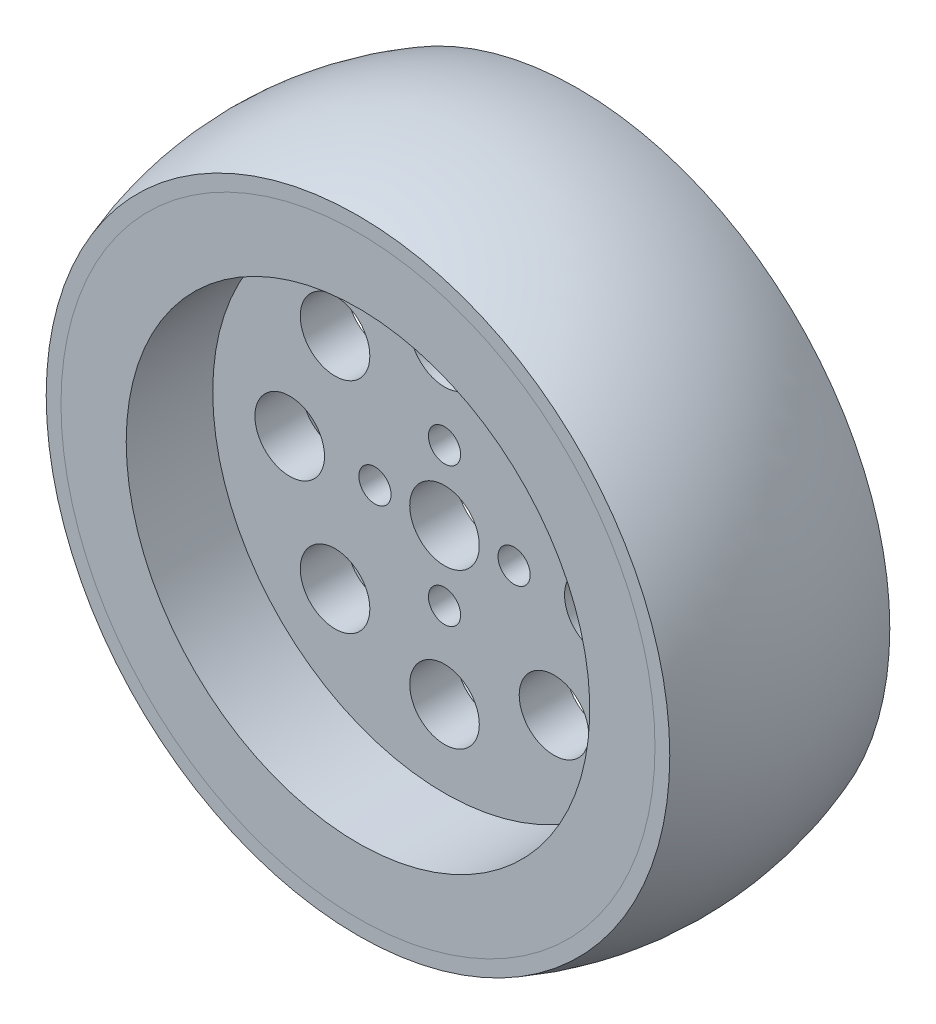
ISO-10303-21;
HEADER;
FILE_DESCRIPTION(('STEP AP214'),'2;1');
FILE_NAME('part.step','',(''),(''),'','','');
FILE_SCHEMA(('AUTOMOTIVE_DESIGN { 1 0 10303 214 1 1 1 1 }'));
ENDSEC;
DATA;
#1=APPLICATION_CONTEXT('core data for automotive mechanical design processes');
#2=APPLICATION_PROTOCOL_DEFINITION('international standard','automotive_design',2000,#1);
#3=PRODUCT_CONTEXT('',#1,'mechanical');
#4=PRODUCT('Part','Part','',(#3));
#5=PRODUCT_RELATED_PRODUCT_CATEGORY('part','',(#4));
#6=PRODUCT_DEFINITION_FORMATION('','',#4);
#7=PRODUCT_DEFINITION_CONTEXT('part definition',#1,'design');
#8=PRODUCT_DEFINITION('design','',#6,#7);
#9=PRODUCT_DEFINITION_SHAPE('','',#8);
#10=(LENGTH_UNIT() NAMED_UNIT(*) SI_UNIT(.MILLI.,.METRE.));
#11=(NAMED_UNIT(*) PLANE_ANGLE_UNIT() SI_UNIT($,.RADIAN.));
#12=(NAMED_UNIT(*) SI_UNIT($,.STERADIAN.) SOLID_ANGLE_UNIT());
#13=UNCERTAINTY_MEASURE_WITH_UNIT(LENGTH_MEASURE(1.E-05),#10,'distance_accuracy_value','');
#14=(GEOMETRIC_REPRESENTATION_CONTEXT(3) GLOBAL_UNCERTAINTY_ASSIGNED_CONTEXT((#13)) GLOBAL_UNIT_ASSIGNED_CONTEXT((#10,
#11,#12)) REPRESENTATION_CONTEXT('',''));
#15=CARTESIAN_POINT('',(0.,0.,0.));
#16=DIRECTION('',(0.,0.,1.));
#17=DIRECTION('',(1.,0.,0.));
#18=AXIS2_PLACEMENT_3D('',#15,#16,#17);
#19=CARTESIAN_POINT('',(26.65,0.,12.65));
#20=DIRECTION('',(0.,0.,-1.));
#21=DIRECTION('',(-1.,0.,0.));
#22=AXIS2_PLACEMENT_3D('',#19,#20,#21);
#23=PLANE('',#22);
#24=CARTESIAN_POINT('',(0.,0.,12.65));
#25=DIRECTION('',(0.,0.,-1.));
#26=DIRECTION('',(-1.,0.,0.));
#27=AXIS2_PLACEMENT_3D('',#24,#25,#26);
#28=CIRCLE('',#27,26.65);
#29=CARTESIAN_POINT('',(-26.65,0.,12.65));
#30=VERTEX_POINT('',#29);
#31=EDGE_CURVE('P0_E161',#30,#30,#28,.T.);
#32=ORIENTED_EDGE('',*,*,#31,.T.);
#33=EDGE_LOOP('',(#32));
#34=FACE_BOUND('',#33,.T.);
#35=CARTESIAN_POINT('',(0.,0.,12.65));
#36=DIRECTION('',(0.,0.,-1.));
#37=DIRECTION('',(-1.,0.,0.));
#38=AXIS2_PLACEMENT_3D('',#35,#36,#37);
#39=CIRCLE('',#38,34.15);
#40=CARTESIAN_POINT('',(-34.15,0.,12.65));
#41=VERTEX_POINT('',#40);
#42=EDGE_CURVE('P0_E10',#41,#41,#39,.T.);
#43=ORIENTED_EDGE('',*,*,#42,.F.);
#44=EDGE_LOOP('',(#43));
#45=FACE_BOUND('',#44,.T.);
#46=ADVANCED_FACE('P0_F15',(#34,#45),#23,.F.);
#47=CARTESIAN_POINT('',(0.,0.,-12.65));
#48=DIRECTION('',(0.,0.,-1.));
#49=DIRECTION('',(-1.,0.,0.));
#50=AXIS2_PLACEMENT_3D('',#47,#48,#49);
#51=CYLINDRICAL_SURFACE('',#50,34.15);
#52=CARTESIAN_POINT('',(0.,0.,10.65));
#53=DIRECTION('',(0.,0.,-1.));
#54=DIRECTION('',(-1.,0.,0.));
#55=AXIS2_PLACEMENT_3D('',#52,#53,#54);
#56=CIRCLE('',#55,34.15);
#57=CARTESIAN_POINT('',(-34.15,0.,10.65));
#58=VERTEX_POINT('',#57);
#59=EDGE_CURVE('P0_E22',#58,#58,#56,.T.);
#60=ORIENTED_EDGE('',*,*,#59,.F.);
#61=EDGE_LOOP('',(#60));
#62=FACE_BOUND('',#61,.T.);
#63=ORIENTED_EDGE('',*,*,#42,.T.);
#64=EDGE_LOOP('',(#63));
#65=FACE_BOUND('',#64,.T.);
#66=ADVANCED_FACE('P0_F203',(#62,#65),#51,.T.);
#67=CARTESIAN_POINT('',(34.15,0.,10.65));
#68=DIRECTION('',(0.,0.,1.));
#69=DIRECTION('',(1.,0.,0.));
#70=AXIS2_PLACEMENT_3D('',#67,#68,#69);
#71=PLANE('',#70);
#72=CARTESIAN_POINT('',(0.,0.,10.65));
#73=DIRECTION('',(0.,0.,-1.));
#74=DIRECTION('',(-1.,0.,0.));
#75=AXIS2_PLACEMENT_3D('',#72,#73,#74);
#76=CIRCLE('',#75,31.85);
#77=CARTESIAN_POINT('',(-31.85,0.,10.65));
#78=VERTEX_POINT('',#77);
#79=EDGE_CURVE('P0_E29',#78,#78,#76,.T.);
#80=ORIENTED_EDGE('',*,*,#79,.F.);
#81=EDGE_LOOP('',(#80));
#82=FACE_BOUND('',#81,.T.);
#83=ORIENTED_EDGE('',*,*,#59,.T.);
#84=EDGE_LOOP('',(#83));
#85=FACE_BOUND('',#84,.T.);
#86=ADVANCED_FACE('P0_F198',(#82,#85),#71,.F.);
#87=CARTESIAN_POINT('',(0.,0.,-12.65));
#88=DIRECTION('',(0.,0.,-1.));
#89=DIRECTION('',(-1.,0.,0.));
#90=AXIS2_PLACEMENT_3D('',#87,#88,#89);
#91=CYLINDRICAL_SURFACE('',#90,31.85);
#92=CARTESIAN_POINT('',(0.,0.,-10.65));
#93=DIRECTION('',(0.,0.,-1.));
#94=DIRECTION('',(-1.,0.,0.));
#95=AXIS2_PLACEMENT_3D('',#92,#93,#94);
#96=CIRCLE('',#95,31.85);
#97=CARTESIAN_POINT('',(-31.85,0.,-10.65));
#98=VERTEX_POINT('',#97);
#99=EDGE_CURVE('P0_E35',#98,#98,#96,.T.);
#100=ORIENTED_EDGE('',*,*,#99,.F.);
#101=EDGE_LOOP('',(#100));
#102=FACE_BOUND('',#101,.T.);
#103=ORIENTED_EDGE('',*,*,#79,.T.);
#104=EDGE_LOOP('',(#103));
#105=FACE_BOUND('',#104,.T.);
#106=ADVANCED_FACE('P0_F192',(#102,#105),#91,.T.);
#107=CARTESIAN_POINT('',(31.85,0.,-10.65));
#108=DIRECTION('',(0.,0.,-1.));
#109=DIRECTION('',(-1.,0.,0.));
#110=AXIS2_PLACEMENT_3D('',#107,#108,#109);
#111=PLANE('',#110);
#112=CARTESIAN_POINT('',(0.,0.,-10.65));
#113=DIRECTION('',(0.,0.,-1.));
#114=DIRECTION('',(-1.,0.,0.));
#115=AXIS2_PLACEMENT_3D('',#112,#113,#114);
#116=CIRCLE('',#115,34.15);
#117=CARTESIAN_POINT('',(-34.15,0.,-10.65));
#118=VERTEX_POINT('',#117);
#119=EDGE_CURVE('P0_E41',#118,#118,#116,.T.);
#120=ORIENTED_EDGE('',*,*,#119,.F.);
#121=EDGE_LOOP('',(#120));
#122=FACE_BOUND('',#121,.T.);
#123=ORIENTED_EDGE('',*,*,#99,.T.);
#124=EDGE_LOOP('',(#123));
#125=FACE_BOUND('',#124,.T.);
#126=ADVANCED_FACE('P0_F186',(#122,#125),#111,.F.);
#127=CARTESIAN_POINT('',(0.,0.,-12.65));
#128=DIRECTION('',(0.,0.,-1.));
#129=DIRECTION('',(-1.,0.,0.));
#130=AXIS2_PLACEMENT_3D('',#127,#128,#129);
#131=CYLINDRICAL_SURFACE('',#130,34.15);
#132=CARTESIAN_POINT('',(0.,0.,-12.65));
#133=DIRECTION('',(0.,0.,-1.));
#134=DIRECTION('',(-1.,0.,0.));
#135=AXIS2_PLACEMENT_3D('',#132,#133,#134);
#136=CIRCLE('',#135,34.15);
#137=CARTESIAN_POINT('',(-34.15,0.,-12.65));
#138=VERTEX_POINT('',#137);
#139=EDGE_CURVE('P0_E45',#138,#138,#136,.T.);
#140=ORIENTED_EDGE('',*,*,#139,.F.);
#141=EDGE_LOOP('',(#140));
#142=FACE_BOUND('',#141,.T.);
#143=ORIENTED_EDGE('',*,*,#119,.T.);
#144=EDGE_LOOP('',(#143));
#145=FACE_BOUND('',#144,.T.);
#146=ADVANCED_FACE('P0_F180',(#142,#145),#131,.T.);
#147=CARTESIAN_POINT('',(34.15,0.,-12.65));
#148=DIRECTION('',(0.,0.,1.));
#149=DIRECTION('',(1.,0.,0.));
#150=AXIS2_PLACEMENT_3D('',#147,#148,#149);
#151=PLANE('',#150);
#152=CARTESIAN_POINT('',(0.,0.,-12.65));
#153=DIRECTION('',(0.,0.,-1.));
#154=DIRECTION('',(-1.,0.,0.));
#155=AXIS2_PLACEMENT_3D('',#152,#153,#154);
#156=CIRCLE('',#155,26.65);
#157=CARTESIAN_POINT('',(-26.65,0.,-12.65));
#158=VERTEX_POINT('',#157);
#159=EDGE_CURVE('P0_E165',#158,#158,#156,.T.);
#160=ORIENTED_EDGE('',*,*,#159,.F.);
#161=EDGE_LOOP('',(#160));
#162=FACE_BOUND('',#161,.T.);
#163=ORIENTED_EDGE('',*,*,#139,.T.);
#164=EDGE_LOOP('',(#163));
#165=FACE_BOUND('',#164,.T.);
#166=ADVANCED_FACE('P0_F176',(#162,#165),#151,.F.);
#167=CARTESIAN_POINT('',(0.,0.,-12.65));
#168=DIRECTION('',(0.,0.,-1.));
#169=DIRECTION('',(-1.,0.,0.));
#170=AXIS2_PLACEMENT_3D('',#167,#168,#169);
#171=CYLINDRICAL_SURFACE('',#170,26.65);
#172=ORIENTED_EDGE('',*,*,#31,.F.);
#173=EDGE_LOOP('',(#172));
#174=FACE_BOUND('',#173,.T.);
#175=CARTESIAN_POINT('',(0.,0.,2.70000000000001));
#176=DIRECTION('',(0.,0.,-1.));
#177=DIRECTION('',(-1.,0.,0.));
#178=AXIS2_PLACEMENT_3D('',#175,#176,#177);
#179=CIRCLE('',#178,26.65);
#180=CARTESIAN_POINT('',(-26.65,0.,2.70000000000002));
#181=VERTEX_POINT('',#180);
#182=EDGE_CURVE('P0_E101',#181,#181,#179,.T.);
#183=ORIENTED_EDGE('',*,*,#182,.T.);
#184=EDGE_LOOP('',(#183));
#185=FACE_BOUND('',#184,.T.);
#186=ADVANCED_FACE('P0_F179',(#174,#185),#171,.F.);
#187=CARTESIAN_POINT('',(0.,0.,-12.65));
#188=DIRECTION('',(0.,0.,-1.));
#189=DIRECTION('',(-1.,0.,0.));
#190=AXIS2_PLACEMENT_3D('',#187,#188,#189);
#191=CYLINDRICAL_SURFACE('',#190,26.65);
#192=CARTESIAN_POINT('',(0.,0.,-2.69999999999999));
#193=DIRECTION('',(0.,0.,-1.));
#194=DIRECTION('',(-1.,0.,0.));
#195=AXIS2_PLACEMENT_3D('',#192,#193,#194);
#196=CIRCLE('',#195,26.65);
#197=CARTESIAN_POINT('',(-26.65,0.,-2.69999999999998));
#198=VERTEX_POINT('',#197);
#199=EDGE_CURVE('P0_E49',#198,#198,#196,.T.);
#200=ORIENTED_EDGE('',*,*,#199,.F.);
#201=EDGE_LOOP('',(#200));
#202=FACE_BOUND('',#201,.T.);
#203=ORIENTED_EDGE('',*,*,#159,.T.);
#204=EDGE_LOOP('',(#203));
#205=FACE_BOUND('',#204,.T.);
#206=ADVANCED_FACE('P0_F174',(#202,#205),#191,.F.);
#207=CARTESIAN_POINT('',(0.,8.,-12.65));
#208=DIRECTION('',(0.,0.,1.));
#209=DIRECTION('',(1.,0.,0.));
#210=AXIS2_PLACEMENT_3D('',#207,#208,#209);
#211=CYLINDRICAL_SURFACE('',#210,1.85);
#212=CARTESIAN_POINT('',(0.,8.,2.7));
#213=DIRECTION('',(0.,0.,-1.));
#214=DIRECTION('',(-1.,0.,0.));
#215=AXIS2_PLACEMENT_3D('',#212,#213,#214);
#216=CIRCLE('',#215,1.85);
#217=CARTESIAN_POINT('',(-1.85,8.,2.70000000000001));
#218=VERTEX_POINT('',#217);
#219=EDGE_CURVE('P0_E105',#218,#218,#216,.T.);
#220=ORIENTED_EDGE('',*,*,#219,.F.);
#221=EDGE_LOOP('',(#220));
#222=FACE_BOUND('',#221,.T.);
#223=CARTESIAN_POINT('',(0.,8.,-2.69999999999999));
#224=DIRECTION('',(0.,0.,1.));
#225=DIRECTION('',(1.,0.,0.));
#226=AXIS2_PLACEMENT_3D('',#223,#224,#225);
#227=CIRCLE('',#226,1.85);
#228=CARTESIAN_POINT('',(1.85,8.,-2.69999999999999));
#229=VERTEX_POINT('',#228);
#230=EDGE_CURVE('P0_E53',#229,#229,#227,.T.);
#231=ORIENTED_EDGE('',*,*,#230,.F.);
#232=EDGE_LOOP('',(#231));
#233=FACE_BOUND('',#232,.T.);
#234=ADVANCED_FACE('P0_F245',(#222,#233),#211,.F.);
#235=CARTESIAN_POINT('',(8.,0.,-12.65));
#236=DIRECTION('',(0.,0.,1.));
#237=DIRECTION('',(1.,0.,0.));
#238=AXIS2_PLACEMENT_3D('',#235,#236,#237);
#239=CYLINDRICAL_SURFACE('',#238,1.85);
#240=CARTESIAN_POINT('',(8.,0.,2.7));
#241=DIRECTION('',(0.,0.,-1.));
#242=DIRECTION('',(-1.,0.,0.));
#243=AXIS2_PLACEMENT_3D('',#240,#241,#242);
#244=CIRCLE('',#243,1.85);
#245=CARTESIAN_POINT('',(6.15,0.,2.7));
#246=VERTEX_POINT('',#245);
#247=EDGE_CURVE('P0_E109',#246,#246,#244,.T.);
#248=ORIENTED_EDGE('',*,*,#247,.F.);
#249=EDGE_LOOP('',(#248));
#250=FACE_BOUND('',#249,.T.);
#251=CARTESIAN_POINT('',(8.,0.,-2.7));
#252=DIRECTION('',(0.,0.,1.));
#253=DIRECTION('',(1.,0.,0.));
#254=AXIS2_PLACEMENT_3D('',#251,#252,#253);
#255=CIRCLE('',#254,1.85);
#256=CARTESIAN_POINT('',(9.85,0.,-2.7));
#257=VERTEX_POINT('',#256);
#258=EDGE_CURVE('P0_E57',#257,#257,#255,.T.);
#259=ORIENTED_EDGE('',*,*,#258,.F.);
#260=EDGE_LOOP('',(#259));
#261=FACE_BOUND('',#260,.T.);
#262=ADVANCED_FACE('P0_F250',(#250,#261),#239,.F.);
#263=CARTESIAN_POINT('',(0.,-8.,-12.65));
#264=DIRECTION('',(0.,0.,1.));
#265=DIRECTION('',(1.,0.,0.));
#266=AXIS2_PLACEMENT_3D('',#263,#264,#265);
#267=CYLINDRICAL_SURFACE('',#266,1.85);
#268=CARTESIAN_POINT('',(0.,-8.,2.7));
#269=DIRECTION('',(0.,0.,-1.));
#270=DIRECTION('',(-1.,0.,0.));
#271=AXIS2_PLACEMENT_3D('',#268,#269,#270);
#272=CIRCLE('',#271,1.85);
#273=CARTESIAN_POINT('',(-1.85,-8.,2.70000000000001));
#274=VERTEX_POINT('',#273);
#275=EDGE_CURVE('P0_E113',#274,#274,#272,.T.);
#276=ORIENTED_EDGE('',*,*,#275,.F.);
#277=EDGE_LOOP('',(#276));
#278=FACE_BOUND('',#277,.T.);
#279=CARTESIAN_POINT('',(0.,-8.,-2.69999999999999));
#280=DIRECTION('',(0.,0.,1.));
#281=DIRECTION('',(1.,0.,0.));
#282=AXIS2_PLACEMENT_3D('',#279,#280,#281);
#283=CIRCLE('',#282,1.85);
#284=CARTESIAN_POINT('',(1.85,-8.,-2.69999999999999));
#285=VERTEX_POINT('',#284);
#286=EDGE_CURVE('P0_E61',#285,#285,#283,.T.);
#287=ORIENTED_EDGE('',*,*,#286,.F.);
#288=EDGE_LOOP('',(#287));
#289=FACE_BOUND('',#288,.T.);
#290=ADVANCED_FACE('P0_F256',(#278,#289),#267,.F.);
#291=CARTESIAN_POINT('',(-8.,0.,-12.65));
#292=DIRECTION('',(0.,0.,1.));
#293=DIRECTION('',(1.,0.,0.));
#294=AXIS2_PLACEMENT_3D('',#291,#292,#293);
#295=CYLINDRICAL_SURFACE('',#294,1.85);
#296=CARTESIAN_POINT('',(-8.,0.,2.70000000000001));
#297=DIRECTION('',(0.,0.,-1.));
#298=DIRECTION('',(-1.,0.,0.));
#299=AXIS2_PLACEMENT_3D('',#296,#297,#298);
#300=CIRCLE('',#299,1.85);
#301=CARTESIAN_POINT('',(-9.85,0.,2.70000000000001));
#302=VERTEX_POINT('',#301);
#303=EDGE_CURVE('P0_E117',#302,#302,#300,.T.);
#304=ORIENTED_EDGE('',*,*,#303,.F.);
#305=EDGE_LOOP('',(#304));
#306=FACE_BOUND('',#305,.T.);
#307=CARTESIAN_POINT('',(-8.,0.,-2.69999999999999));
#308=DIRECTION('',(0.,0.,1.));
#309=DIRECTION('',(1.,0.,0.));
#310=AXIS2_PLACEMENT_3D('',#307,#308,#309);
#311=CIRCLE('',#310,1.85);
#312=CARTESIAN_POINT('',(-6.15,0.,-2.69999999999999));
#313=VERTEX_POINT('',#312);
#314=EDGE_CURVE('P0_E65',#313,#313,#311,.T.);
#315=ORIENTED_EDGE('',*,*,#314,.F.);
#316=EDGE_LOOP('',(#315));
#317=FACE_BOUND('',#316,.T.);
#318=ADVANCED_FACE('P0_F260',(#306,#317),#295,.F.);
#319=CARTESIAN_POINT('',(0.,17.8,-12.65));
#320=DIRECTION('',(0.,0.,1.));
#321=DIRECTION('',(1.,0.,0.));
#322=AXIS2_PLACEMENT_3D('',#319,#320,#321);
#323=CYLINDRICAL_SURFACE('',#322,4.);
#324=CARTESIAN_POINT('',(0.,17.8,2.7));
#325=DIRECTION('',(0.,0.,-1.));
#326=DIRECTION('',(-1.,0.,0.));
#327=AXIS2_PLACEMENT_3D('',#324,#325,#326);
#328=CIRCLE('',#327,4.);
#329=CARTESIAN_POINT('',(-4.,17.8,2.70000000000001));
#330=VERTEX_POINT('',#329);
#331=EDGE_CURVE('P0_E121',#330,#330,#328,.T.);
#332=ORIENTED_EDGE('',*,*,#331,.F.);
#333=EDGE_LOOP('',(#332));
#334=FACE_BOUND('',#333,.T.);
#335=CARTESIAN_POINT('',(0.,17.8,-2.69999999999999));
#336=DIRECTION('',(0.,0.,1.));
#337=DIRECTION('',(1.,0.,0.));
#338=AXIS2_PLACEMENT_3D('',#335,#336,#337);
#339=CIRCLE('',#338,4.);
#340=CARTESIAN_POINT('',(4.,17.8,-2.7));
#341=VERTEX_POINT('',#340);
#342=EDGE_CURVE('P0_E69',#341,#341,#339,.T.);
#343=ORIENTED_EDGE('',*,*,#342,.F.);
#344=EDGE_LOOP('',(#343));
#345=FACE_BOUND('',#344,.T.);
#346=ADVANCED_FACE('P0_F264',(#334,#345),#323,.F.);
#347=CARTESIAN_POINT('',(12.5865007051205,12.5865007051206,-12.65));
#348=DIRECTION('',(0.,0.,1.));
#349=DIRECTION('',(1.,0.,0.));
#350=AXIS2_PLACEMENT_3D('',#347,#348,#349);
#351=CYLINDRICAL_SURFACE('',#350,3.99999999999999);
#352=CARTESIAN_POINT('',(12.5865007051205,12.5865007051206,2.7));
#353=DIRECTION('',(0.,0.,-1.));
#354=DIRECTION('',(-1.,0.,0.));
#355=AXIS2_PLACEMENT_3D('',#352,#353,#354);
#356=CIRCLE('',#355,3.99999999999999);
#357=CARTESIAN_POINT('',(8.58650070512047,12.5865007051206,2.7));
#358=VERTEX_POINT('',#357);
#359=EDGE_CURVE('P0_E125',#358,#358,#356,.T.);
#360=ORIENTED_EDGE('',*,*,#359,.F.);
#361=EDGE_LOOP('',(#360));
#362=FACE_BOUND('',#361,.T.);
#363=CARTESIAN_POINT('',(12.5865007051205,12.5865007051206,-2.7));
#364=DIRECTION('',(0.,0.,1.));
#365=DIRECTION('',(1.,0.,0.));
#366=AXIS2_PLACEMENT_3D('',#363,#364,#365);
#367=CIRCLE('',#366,3.99999999999999);
#368=CARTESIAN_POINT('',(16.5865007051205,12.5865007051206,-2.7));
#369=VERTEX_POINT('',#368);
#370=EDGE_CURVE('P0_E73',#369,#369,#367,.T.);
#371=ORIENTED_EDGE('',*,*,#370,.F.);
#372=EDGE_LOOP('',(#371));
#373=FACE_BOUND('',#372,.T.);
#374=ADVANCED_FACE('P0_F268',(#362,#373),#351,.F.);
#375=CARTESIAN_POINT('',(17.8,0.,-12.65));
#376=DIRECTION('',(0.,0.,1.));
#377=DIRECTION('',(1.,0.,0.));
#378=AXIS2_PLACEMENT_3D('',#375,#376,#377);
#379=CYLINDRICAL_SURFACE('',#378,4.);
#380=CARTESIAN_POINT('',(17.8,0.,2.7));
#381=DIRECTION('',(0.,0.,-1.));
#382=DIRECTION('',(-1.,0.,0.));
#383=AXIS2_PLACEMENT_3D('',#380,#381,#382);
#384=CIRCLE('',#383,4.);
#385=CARTESIAN_POINT('',(13.8,0.,2.7));
#386=VERTEX_POINT('',#385);
#387=EDGE_CURVE('P0_E129',#386,#386,#384,.T.);
#388=ORIENTED_EDGE('',*,*,#387,.F.);
#389=EDGE_LOOP('',(#388));
#390=FACE_BOUND('',#389,.T.);
#391=CARTESIAN_POINT('',(17.8,0.,-2.7));
#392=DIRECTION('',(0.,0.,1.));
#393=DIRECTION('',(1.,0.,0.));
#394=AXIS2_PLACEMENT_3D('',#391,#392,#393);
#395=CIRCLE('',#394,4.);
#396=CARTESIAN_POINT('',(21.8,0.,-2.7));
#397=VERTEX_POINT('',#396);
#398=EDGE_CURVE('P0_E77',#397,#397,#395,.T.);
#399=ORIENTED_EDGE('',*,*,#398,.F.);
#400=EDGE_LOOP('',(#399));
#401=FACE_BOUND('',#400,.T.);
#402=ADVANCED_FACE('P0_F272',(#390,#401),#379,.F.);
#403=CARTESIAN_POINT('',(12.5865007051206,-12.5865007051205,-12.65));
#404=DIRECTION('',(0.,0.,1.));
#405=DIRECTION('',(1.,0.,0.));
#406=AXIS2_PLACEMENT_3D('',#403,#404,#405);
#407=CYLINDRICAL_SURFACE('',#406,4.);
#408=CARTESIAN_POINT('',(12.5865007051206,-12.5865007051205,2.7));
#409=DIRECTION('',(0.,0.,-1.));
#410=DIRECTION('',(-1.,0.,0.));
#411=AXIS2_PLACEMENT_3D('',#408,#409,#410);
#412=CIRCLE('',#411,4.);
#413=CARTESIAN_POINT('',(8.58650070512061,-12.5865007051205,2.7));
#414=VERTEX_POINT('',#413);
#415=EDGE_CURVE('P0_E133',#414,#414,#412,.T.);
#416=ORIENTED_EDGE('',*,*,#415,.F.);
#417=EDGE_LOOP('',(#416));
#418=FACE_BOUND('',#417,.T.);
#419=CARTESIAN_POINT('',(12.5865007051206,-12.5865007051205,-2.7));
#420=DIRECTION('',(0.,0.,1.));
#421=DIRECTION('',(1.,0.,0.));
#422=AXIS2_PLACEMENT_3D('',#419,#420,#421);
#423=CIRCLE('',#422,4.);
#424=CARTESIAN_POINT('',(16.5865007051206,-12.5865007051205,-2.7));
#425=VERTEX_POINT('',#424);
#426=EDGE_CURVE('P0_E81',#425,#425,#423,.T.);
#427=ORIENTED_EDGE('',*,*,#426,.F.);
#428=EDGE_LOOP('',(#427));
#429=FACE_BOUND('',#428,.T.);
#430=ADVANCED_FACE('P0_F276',(#418,#429),#407,.F.);
#431=CARTESIAN_POINT('',(0.,-17.8,-12.65));
#432=DIRECTION('',(0.,0.,1.));
#433=DIRECTION('',(1.,0.,0.));
#434=AXIS2_PLACEMENT_3D('',#431,#432,#433);
#435=CYLINDRICAL_SURFACE('',#434,4.);
#436=CARTESIAN_POINT('',(0.,-17.8,2.7));
#437=DIRECTION('',(0.,0.,-1.));
#438=DIRECTION('',(-1.,0.,0.));
#439=AXIS2_PLACEMENT_3D('',#436,#437,#438);
#440=CIRCLE('',#439,4.);
#441=CARTESIAN_POINT('',(-4.,-17.8,2.70000000000001));
#442=VERTEX_POINT('',#441);
#443=EDGE_CURVE('P0_E137',#442,#442,#440,.T.);
#444=ORIENTED_EDGE('',*,*,#443,.F.);
#445=EDGE_LOOP('',(#444));
#446=FACE_BOUND('',#445,.T.);
#447=CARTESIAN_POINT('',(0.,-17.8,-2.69999999999999));
#448=DIRECTION('',(0.,0.,1.));
#449=DIRECTION('',(1.,0.,0.));
#450=AXIS2_PLACEMENT_3D('',#447,#448,#449);
#451=CIRCLE('',#450,4.);
#452=CARTESIAN_POINT('',(4.,-17.8,-2.7));
#453=VERTEX_POINT('',#452);
#454=EDGE_CURVE('P0_E85',#453,#453,#451,.T.);
#455=ORIENTED_EDGE('',*,*,#454,.F.);
#456=EDGE_LOOP('',(#455));
#457=FACE_BOUND('',#456,.T.);
#458=ADVANCED_FACE('P0_F280',(#446,#457),#435,.F.);
#459=CARTESIAN_POINT('',(-12.5865007051205,-12.5865007051206,-12.65));
#460=DIRECTION('',(0.,0.,1.));
#461=DIRECTION('',(1.,0.,0.));
#462=AXIS2_PLACEMENT_3D('',#459,#460,#461);
#463=CYLINDRICAL_SURFACE('',#462,4.);
#464=CARTESIAN_POINT('',(-12.5865007051205,-12.5865007051206,2.70000000000001));
#465=DIRECTION('',(0.,0.,-1.));
#466=DIRECTION('',(-1.,0.,0.));
#467=AXIS2_PLACEMENT_3D('',#464,#465,#466);
#468=CIRCLE('',#467,4.);
#469=CARTESIAN_POINT('',(-16.5865007051205,-12.5865007051206,2.70000000000001));
#470=VERTEX_POINT('',#469);
#471=EDGE_CURVE('P0_E141',#470,#470,#468,.T.);
#472=ORIENTED_EDGE('',*,*,#471,.F.);
#473=EDGE_LOOP('',(#472));
#474=FACE_BOUND('',#473,.T.);
#475=CARTESIAN_POINT('',(-12.5865007051205,-12.5865007051206,-2.69999999999999));
#476=DIRECTION('',(0.,0.,1.));
#477=DIRECTION('',(1.,0.,0.));
#478=AXIS2_PLACEMENT_3D('',#475,#476,#477);
#479=CIRCLE('',#478,4.);
#480=CARTESIAN_POINT('',(-8.58650070512048,-12.5865007051206,-2.69999999999999));
#481=VERTEX_POINT('',#480);
#482=EDGE_CURVE('P0_E89',#481,#481,#479,.T.);
#483=ORIENTED_EDGE('',*,*,#482,.F.);
#484=EDGE_LOOP('',(#483));
#485=FACE_BOUND('',#484,.T.);
#486=ADVANCED_FACE('P0_F284',(#474,#485),#463,.F.);
#487=CARTESIAN_POINT('',(-17.8,0.,-12.65));
#488=DIRECTION('',(0.,0.,1.));
#489=DIRECTION('',(1.,0.,0.));
#490=AXIS2_PLACEMENT_3D('',#487,#488,#489);
#491=CYLINDRICAL_SURFACE('',#490,4.);
#492=CARTESIAN_POINT('',(-17.8,0.,2.70000000000001));
#493=DIRECTION('',(0.,0.,-1.));
#494=DIRECTION('',(-1.,0.,0.));
#495=AXIS2_PLACEMENT_3D('',#492,#493,#494);
#496=CIRCLE('',#495,4.);
#497=CARTESIAN_POINT('',(-21.8,0.,2.70000000000001));
#498=VERTEX_POINT('',#497);
#499=EDGE_CURVE('P0_E145',#498,#498,#496,.T.);
#500=ORIENTED_EDGE('',*,*,#499,.F.);
#501=EDGE_LOOP('',(#500));
#502=FACE_BOUND('',#501,.T.);
#503=CARTESIAN_POINT('',(-17.8,0.,-2.69999999999999));
#504=DIRECTION('',(0.,0.,1.));
#505=DIRECTION('',(1.,0.,0.));
#506=AXIS2_PLACEMENT_3D('',#503,#504,#505);
#507=CIRCLE('',#506,4.);
#508=CARTESIAN_POINT('',(-13.8,0.,-2.69999999999999));
#509=VERTEX_POINT('',#508);
#510=EDGE_CURVE('P0_E93',#509,#509,#507,.T.);
#511=ORIENTED_EDGE('',*,*,#510,.F.);
#512=EDGE_LOOP('',(#511));
#513=FACE_BOUND('',#512,.T.);
#514=ADVANCED_FACE('P0_F239',(#502,#513),#491,.F.);
#515=CARTESIAN_POINT('',(26.65,0.,-2.7));
#516=DIRECTION('',(0.,0.,1.));
#517=DIRECTION('',(1.,0.,0.));
#518=AXIS2_PLACEMENT_3D('',#515,#516,#517);
#519=PLANE('',#518);
#520=CARTESIAN_POINT('',(-12.5865007051206,12.5865007051205,-2.69999999999999));
#521=DIRECTION('',(0.,0.,1.));
#522=DIRECTION('',(1.,0.,0.));
#523=AXIS2_PLACEMENT_3D('',#520,#521,#522);
#524=CIRCLE('',#523,4.);
#525=CARTESIAN_POINT('',(-8.58650070512062,12.5865007051205,-2.69999999999999));
#526=VERTEX_POINT('',#525);
#527=EDGE_CURVE('P0_E97',#526,#526,#524,.T.);
#528=ORIENTED_EDGE('',*,*,#527,.T.);
#529=EDGE_LOOP('',(#528));
#530=FACE_BOUND('',#529,.T.);
#531=ORIENTED_EDGE('',*,*,#510,.T.);
#532=EDGE_LOOP('',(#531));
#533=FACE_BOUND('',#532,.T.);
#534=ORIENTED_EDGE('',*,*,#482,.T.);
#535=EDGE_LOOP('',(#534));
#536=FACE_BOUND('',#535,.T.);
#537=ORIENTED_EDGE('',*,*,#454,.T.);
#538=EDGE_LOOP('',(#537));
#539=FACE_BOUND('',#538,.T.);
#540=ORIENTED_EDGE('',*,*,#426,.T.);
#541=EDGE_LOOP('',(#540));
#542=FACE_BOUND('',#541,.T.);
#543=ORIENTED_EDGE('',*,*,#398,.T.);
#544=EDGE_LOOP('',(#543));
#545=FACE_BOUND('',#544,.T.);
#546=ORIENTED_EDGE('',*,*,#370,.T.);
#547=EDGE_LOOP('',(#546));
#548=FACE_BOUND('',#547,.T.);
#549=ORIENTED_EDGE('',*,*,#342,.T.);
#550=EDGE_LOOP('',(#549));
#551=FACE_BOUND('',#550,.T.);
#552=ORIENTED_EDGE('',*,*,#314,.T.);
#553=EDGE_LOOP('',(#552));
#554=FACE_BOUND('',#553,.T.);
#555=ORIENTED_EDGE('',*,*,#286,.T.);
#556=EDGE_LOOP('',(#555));
#557=FACE_BOUND('',#556,.T.);
#558=ORIENTED_EDGE('',*,*,#258,.T.);
#559=EDGE_LOOP('',(#558));
#560=FACE_BOUND('',#559,.T.);
#561=ORIENTED_EDGE('',*,*,#230,.T.);
#562=EDGE_LOOP('',(#561));
#563=FACE_BOUND('',#562,.T.);
#564=CARTESIAN_POINT('',(0.,0.,-2.7));
#565=DIRECTION('',(0.,0.,-1.));
#566=DIRECTION('',(-1.,0.,0.));
#567=AXIS2_PLACEMENT_3D('',#564,#565,#566);
#568=CIRCLE('',#567,4.);
#569=CARTESIAN_POINT('',(-4.00000000000001,0.,-2.69999999999999));
#570=VERTEX_POINT('',#569);
#571=EDGE_CURVE('P0_E153',#570,#570,#568,.T.);
#572=ORIENTED_EDGE('',*,*,#571,.F.);
#573=EDGE_LOOP('',(#572));
#574=FACE_BOUND('',#573,.T.);
#575=ORIENTED_EDGE('',*,*,#199,.T.);
#576=EDGE_LOOP('',(#575));
#577=FACE_BOUND('',#576,.T.);
#578=ADVANCED_FACE('P0_F236',(#530,#533,#536,#539,#542,#545,#548,#551,#554,#557,#560,#563,#574,
#577),#519,.F.);
#579=CARTESIAN_POINT('',(-12.5865007051206,12.5865007051205,-12.65));
#580=DIRECTION('',(0.,0.,1.));
#581=DIRECTION('',(1.,0.,0.));
#582=AXIS2_PLACEMENT_3D('',#579,#580,#581);
#583=CYLINDRICAL_SURFACE('',#582,4.);
#584=CARTESIAN_POINT('',(-12.5865007051206,12.5865007051205,2.70000000000001));
#585=DIRECTION('',(0.,0.,-1.));
#586=DIRECTION('',(-1.,0.,0.));
#587=AXIS2_PLACEMENT_3D('',#584,#585,#586);
#588=CIRCLE('',#587,4.);
#589=CARTESIAN_POINT('',(-16.5865007051206,12.5865007051205,2.70000000000001));
#590=VERTEX_POINT('',#589);
#591=EDGE_CURVE('P0_E149',#590,#590,#588,.T.);
#592=ORIENTED_EDGE('',*,*,#591,.F.);
#593=EDGE_LOOP('',(#592));
#594=FACE_BOUND('',#593,.T.);
#595=ORIENTED_EDGE('',*,*,#527,.F.);
#596=EDGE_LOOP('',(#595));
#597=FACE_BOUND('',#596,.T.);
#598=ADVANCED_FACE('P0_F226',(#594,#597),#583,.F.);
#599=CARTESIAN_POINT('',(4.,0.,2.7));
#600=DIRECTION('',(0.,0.,-1.));
#601=DIRECTION('',(-1.,0.,0.));
#602=AXIS2_PLACEMENT_3D('',#599,#600,#601);
#603=PLANE('',#602);
#604=ORIENTED_EDGE('',*,*,#591,.T.);
#605=EDGE_LOOP('',(#604));
#606=FACE_BOUND('',#605,.T.);
#607=ORIENTED_EDGE('',*,*,#499,.T.);
#608=EDGE_LOOP('',(#607));
#609=FACE_BOUND('',#608,.T.);
#610=ORIENTED_EDGE('',*,*,#471,.T.);
#611=EDGE_LOOP('',(#610));
#612=FACE_BOUND('',#611,.T.);
#613=ORIENTED_EDGE('',*,*,#443,.T.);
#614=EDGE_LOOP('',(#613));
#615=FACE_BOUND('',#614,.T.);
#616=ORIENTED_EDGE('',*,*,#415,.T.);
#617=EDGE_LOOP('',(#616));
#618=FACE_BOUND('',#617,.T.);
#619=ORIENTED_EDGE('',*,*,#387,.T.);
#620=EDGE_LOOP('',(#619));
#621=FACE_BOUND('',#620,.T.);
#622=ORIENTED_EDGE('',*,*,#359,.T.);
#623=EDGE_LOOP('',(#622));
#624=FACE_BOUND('',#623,.T.);
#625=ORIENTED_EDGE('',*,*,#331,.T.);
#626=EDGE_LOOP('',(#625));
#627=FACE_BOUND('',#626,.T.);
#628=ORIENTED_EDGE('',*,*,#303,.T.);
#629=EDGE_LOOP('',(#628));
#630=FACE_BOUND('',#629,.T.);
#631=ORIENTED_EDGE('',*,*,#275,.T.);
#632=EDGE_LOOP('',(#631));
#633=FACE_BOUND('',#632,.T.);
#634=ORIENTED_EDGE('',*,*,#247,.T.);
#635=EDGE_LOOP('',(#634));
#636=FACE_BOUND('',#635,.T.);
#637=ORIENTED_EDGE('',*,*,#219,.T.);
#638=EDGE_LOOP('',(#637));
#639=FACE_BOUND('',#638,.T.);
#640=ORIENTED_EDGE('',*,*,#182,.F.);
#641=EDGE_LOOP('',(#640));
#642=FACE_BOUND('',#641,.T.);
#643=CARTESIAN_POINT('',(0.,0.,2.7));
#644=DIRECTION('',(0.,0.,-1.));
#645=DIRECTION('',(-1.,0.,0.));
#646=AXIS2_PLACEMENT_3D('',#643,#644,#645);
#647=CIRCLE('',#646,4.);
#648=CARTESIAN_POINT('',(-4.,0.,2.7));
#649=VERTEX_POINT('',#648);
#650=EDGE_CURVE('P0_E157',#649,#649,#647,.T.);
#651=ORIENTED_EDGE('',*,*,#650,.T.);
#652=EDGE_LOOP('',(#651));
#653=FACE_BOUND('',#652,.T.);
#654=ADVANCED_FACE('P0_F222',(#606,#609,#612,#615,#618,#621,#624,#627,#630,#633,#636,#639,#642,
#653),#603,.F.);
#655=CARTESIAN_POINT('',(0.,0.,-12.65));
#656=DIRECTION('',(0.,0.,-1.));
#657=DIRECTION('',(-1.,0.,0.));
#658=AXIS2_PLACEMENT_3D('',#655,#656,#657);
#659=CYLINDRICAL_SURFACE('',#658,4.);
#660=ORIENTED_EDGE('',*,*,#650,.F.);
#661=EDGE_LOOP('',(#660));
#662=FACE_BOUND('',#661,.T.);
#663=ORIENTED_EDGE('',*,*,#571,.T.);
#664=EDGE_LOOP('',(#663));
#665=FACE_BOUND('',#664,.T.);
#666=ADVANCED_FACE('P0_F225',(#662,#665),#659,.F.);
#667=CLOSED_SHELL('',(#46,#66,#86,#106,#126,#146,#166,#186,#206,#234,#262,#290,#318,#346,#374,
#402,#430,#458,#486,#514,#578,#598,#654,#666));
#668=MANIFOLD_SOLID_BREP('P0_B1',#667);
#669=CARTESIAN_POINT('',(34.15,0.,-12.65));
#670=DIRECTION('',(0.,0.,1.));
#671=DIRECTION('',(1.,0.,0.));
#672=AXIS2_PLACEMENT_3D('',#669,#670,#671);
#673=PLANE('',#672);
#674=CARTESIAN_POINT('',(0.,0.,-12.65));
#675=DIRECTION('',(0.,0.,-1.));
#676=DIRECTION('',(-1.,0.,0.));
#677=AXIS2_PLACEMENT_3D('',#674,#675,#676);
#678=CIRCLE('',#677,34.15);
#679=CARTESIAN_POINT('',(-34.15,0.,-12.65));
#680=VERTEX_POINT('',#679);
#681=EDGE_CURVE('P1_E49',#680,#680,#678,.T.);
#682=ORIENTED_EDGE('',*,*,#681,.F.);
#683=EDGE_LOOP('',(#682));
#684=FACE_BOUND('',#683,.T.);
#685=CARTESIAN_POINT('',(0.,0.,-12.65));
#686=DIRECTION('',(0.,0.,-1.));
#687=DIRECTION('',(-1.,0.,0.));
#688=AXIS2_PLACEMENT_3D('',#685,#686,#687);
#689=CIRCLE('',#688,35.85);
#690=CARTESIAN_POINT('',(-35.85,0.,-12.65));
#691=VERTEX_POINT('',#690);
#692=EDGE_CURVE('P1_E9',#691,#691,#689,.T.);
#693=ORIENTED_EDGE('',*,*,#692,.T.);
#694=EDGE_LOOP('',(#693));
#695=FACE_BOUND('',#694,.T.);
#696=ADVANCED_FACE('P1_F14',(#684,#695),#673,.F.);
#697=CARTESIAN_POINT('',(0.,0.,0.));
#698=DIRECTION('',(0.,0.,-1.));
#699=DIRECTION('',(-1.,0.,0.));
#700=AXIS2_PLACEMENT_3D('',#697,#698,#699);
#701=DEGENERATE_TOROIDAL_SURFACE('',#700,1.41444444444449,36.6855555555555,.T.);
#702=ORIENTED_EDGE('',*,*,#692,.F.);
#703=EDGE_LOOP('',(#702));
#704=FACE_BOUND('',#703,.T.);
#705=CARTESIAN_POINT('',(0.,0.,12.65));
#706=DIRECTION('',(0.,0.,-1.));
#707=DIRECTION('',(-1.,0.,0.));
#708=AXIS2_PLACEMENT_3D('',#705,#706,#707);
#709=CIRCLE('',#708,35.85);
#710=CARTESIAN_POINT('',(-35.85,0.,12.65));
#711=VERTEX_POINT('',#710);
#712=EDGE_CURVE('P1_E21',#711,#711,#709,.T.);
#713=ORIENTED_EDGE('',*,*,#712,.T.);
#714=EDGE_LOOP('',(#713));
#715=FACE_BOUND('',#714,.T.);
#716=ADVANCED_FACE('P1_F95',(#704,#715),#701,.T.);
#717=CARTESIAN_POINT('',(34.15,0.,12.65));
#718=DIRECTION('',(0.,0.,-1.));
#719=DIRECTION('',(-1.,0.,0.));
#720=AXIS2_PLACEMENT_3D('',#717,#718,#719);
#721=PLANE('',#720);
#722=CARTESIAN_POINT('',(0.,0.,12.65));
#723=DIRECTION('',(0.,0.,-1.));
#724=DIRECTION('',(-1.,0.,0.));
#725=AXIS2_PLACEMENT_3D('',#722,#723,#724);
#726=CIRCLE('',#725,34.15);
#727=CARTESIAN_POINT('',(-34.15,0.,12.65));
#728=VERTEX_POINT('',#727);
#729=EDGE_CURVE('P1_E53',#728,#728,#726,.T.);
#730=ORIENTED_EDGE('',*,*,#729,.T.);
#731=EDGE_LOOP('',(#730));
#732=FACE_BOUND('',#731,.T.);
#733=ORIENTED_EDGE('',*,*,#712,.F.);
#734=EDGE_LOOP('',(#733));
#735=FACE_BOUND('',#734,.T.);
#736=ADVANCED_FACE('P1_F61',(#732,#735),#721,.F.);
#737=CARTESIAN_POINT('',(0.,0.,0.));
#738=DIRECTION('',(0.,0.,-1.));
#739=DIRECTION('',(-1.,0.,0.));
#740=AXIS2_PLACEMENT_3D('',#737,#738,#739);
#741=CYLINDRICAL_SURFACE('',#740,34.15);
#742=CARTESIAN_POINT('',(0.,0.,-10.65));
#743=DIRECTION('',(0.,0.,-1.));
#744=DIRECTION('',(-1.,0.,0.));
#745=AXIS2_PLACEMENT_3D('',#742,#743,#744);
#746=CIRCLE('',#745,34.15);
#747=CARTESIAN_POINT('',(-34.15,0.,-10.65));
#748=VERTEX_POINT('',#747);
#749=EDGE_CURVE('P1_E28',#748,#748,#746,.T.);
#750=ORIENTED_EDGE('',*,*,#749,.F.);
#751=EDGE_LOOP('',(#750));
#752=FACE_BOUND('',#751,.T.);
#753=ORIENTED_EDGE('',*,*,#681,.T.);
#754=EDGE_LOOP('',(#753));
#755=FACE_BOUND('',#754,.T.);
#756=ADVANCED_FACE('P1_F85',(#752,#755),#741,.F.);
#757=CARTESIAN_POINT('',(31.85,0.,-10.65));
#758=DIRECTION('',(0.,0.,1.));
#759=DIRECTION('',(1.,0.,0.));
#760=AXIS2_PLACEMENT_3D('',#757,#758,#759);
#761=PLANE('',#760);
#762=CARTESIAN_POINT('',(0.,0.,-10.65));
#763=DIRECTION('',(0.,0.,-1.));
#764=DIRECTION('',(-1.,0.,0.));
#765=AXIS2_PLACEMENT_3D('',#762,#763,#764);
#766=CIRCLE('',#765,31.85);
#767=CARTESIAN_POINT('',(-31.85,0.,-10.65));
#768=VERTEX_POINT('',#767);
#769=EDGE_CURVE('P1_E41',#768,#768,#766,.T.);
#770=ORIENTED_EDGE('',*,*,#769,.F.);
#771=EDGE_LOOP('',(#770));
#772=FACE_BOUND('',#771,.T.);
#773=ORIENTED_EDGE('',*,*,#749,.T.);
#774=EDGE_LOOP('',(#773));
#775=FACE_BOUND('',#774,.T.);
#776=ADVANCED_FACE('P1_F68',(#772,#775),#761,.F.);
#777=CARTESIAN_POINT('',(0.,0.,0.));
#778=DIRECTION('',(0.,0.,-1.));
#779=DIRECTION('',(-1.,0.,0.));
#780=AXIS2_PLACEMENT_3D('',#777,#778,#779);
#781=CYLINDRICAL_SURFACE('',#780,34.15);
#782=ORIENTED_EDGE('',*,*,#729,.F.);
#783=EDGE_LOOP('',(#782));
#784=FACE_BOUND('',#783,.T.);
#785=CARTESIAN_POINT('',(0.,0.,10.65));
#786=DIRECTION('',(0.,0.,-1.));
#787=DIRECTION('',(-1.,0.,0.));
#788=AXIS2_PLACEMENT_3D('',#785,#786,#787);
#789=CIRCLE('',#788,34.15);
#790=CARTESIAN_POINT('',(-34.15,0.,10.65));
#791=VERTEX_POINT('',#790);
#792=EDGE_CURVE('P1_E35',#791,#791,#789,.T.);
#793=ORIENTED_EDGE('',*,*,#792,.T.);
#794=EDGE_LOOP('',(#793));
#795=FACE_BOUND('',#794,.T.);
#796=ADVANCED_FACE('P1_F64',(#784,#795),#781,.F.);
#797=CARTESIAN_POINT('',(34.15,0.,10.65));
#798=DIRECTION('',(0.,0.,-1.));
#799=DIRECTION('',(-1.,0.,0.));
#800=AXIS2_PLACEMENT_3D('',#797,#798,#799);
#801=PLANE('',#800);
#802=ORIENTED_EDGE('',*,*,#792,.F.);
#803=EDGE_LOOP('',(#802));
#804=FACE_BOUND('',#803,.T.);
#805=CARTESIAN_POINT('',(0.,0.,10.65));
#806=DIRECTION('',(0.,0.,-1.));
#807=DIRECTION('',(-1.,0.,0.));
#808=AXIS2_PLACEMENT_3D('',#805,#806,#807);
#809=CIRCLE('',#808,31.85);
#810=CARTESIAN_POINT('',(-31.85,0.,10.65));
#811=VERTEX_POINT('',#810);
#812=EDGE_CURVE('P1_E45',#811,#811,#809,.T.);
#813=ORIENTED_EDGE('',*,*,#812,.T.);
#814=EDGE_LOOP('',(#813));
#815=FACE_BOUND('',#814,.T.);
#816=ADVANCED_FACE('P1_F67',(#804,#815),#801,.F.);
#817=CARTESIAN_POINT('',(0.,0.,0.));
#818=DIRECTION('',(0.,0.,-1.));
#819=DIRECTION('',(-1.,0.,0.));
#820=AXIS2_PLACEMENT_3D('',#817,#818,#819);
#821=CYLINDRICAL_SURFACE('',#820,31.85);
#822=ORIENTED_EDGE('',*,*,#812,.F.);
#823=EDGE_LOOP('',(#822));
#824=FACE_BOUND('',#823,.T.);
#825=ORIENTED_EDGE('',*,*,#769,.T.);
#826=EDGE_LOOP('',(#825));
#827=FACE_BOUND('',#826,.T.);
#828=ADVANCED_FACE('P1_F74',(#824,#827),#821,.F.);
#829=CLOSED_SHELL('',(#696,#716,#736,#756,#776,#796,#816,#828));
#830=MANIFOLD_SOLID_BREP('P1_B1',#829);
#831=ADVANCED_BREP_SHAPE_REPRESENTATION('',(#18,#668,#830),#14);
#832=SHAPE_DEFINITION_REPRESENTATION(#9,#831);
ENDSEC;
END-ISO-10303-21;
